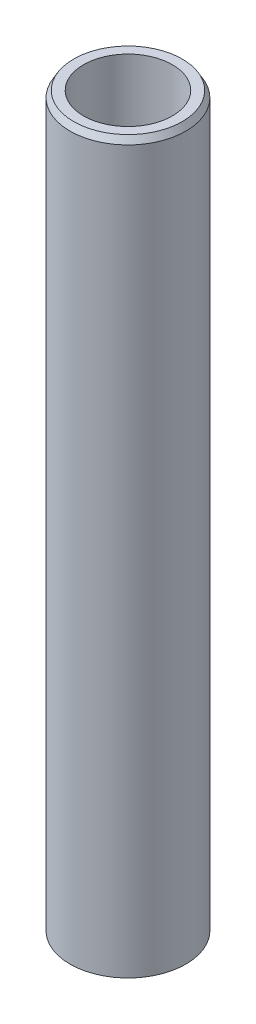
ISO-10303-21;
HEADER;
FILE_DESCRIPTION(('STEP AP214'),'2;1');
FILE_NAME('part.step','',(''),(''),'','','');
FILE_SCHEMA(('AUTOMOTIVE_DESIGN { 1 0 10303 214 1 1 1 1 }'));
ENDSEC;
DATA;
#1=APPLICATION_CONTEXT('core data for automotive mechanical design processes');
#2=APPLICATION_PROTOCOL_DEFINITION('international standard','automotive_design',2000,#1);
#3=PRODUCT_CONTEXT('',#1,'mechanical');
#4=PRODUCT('Part','Part','',(#3));
#5=PRODUCT_RELATED_PRODUCT_CATEGORY('part','',(#4));
#6=PRODUCT_DEFINITION_FORMATION('','',#4);
#7=PRODUCT_DEFINITION_CONTEXT('part definition',#1,'design');
#8=PRODUCT_DEFINITION('design','',#6,#7);
#9=PRODUCT_DEFINITION_SHAPE('','',#8);
#10=(LENGTH_UNIT() NAMED_UNIT(*) SI_UNIT(.MILLI.,.METRE.));
#11=(NAMED_UNIT(*) PLANE_ANGLE_UNIT() SI_UNIT($,.RADIAN.));
#12=(NAMED_UNIT(*) SI_UNIT($,.STERADIAN.) SOLID_ANGLE_UNIT());
#13=UNCERTAINTY_MEASURE_WITH_UNIT(LENGTH_MEASURE(1.E-05),#10,'distance_accuracy_value','');
#14=(GEOMETRIC_REPRESENTATION_CONTEXT(3) GLOBAL_UNCERTAINTY_ASSIGNED_CONTEXT((#13)) GLOBAL_UNIT_ASSIGNED_CONTEXT((#10,
#11,#12)) REPRESENTATION_CONTEXT('',''));
#15=CARTESIAN_POINT('',(0.,0.,0.));
#16=DIRECTION('',(0.,0.,1.));
#17=DIRECTION('',(1.,0.,0.));
#18=AXIS2_PLACEMENT_3D('',#15,#16,#17);
#19=CARTESIAN_POINT('',(0.,568.066885723914,0.));
#20=DIRECTION('',(0.,-1.,0.));
#21=DIRECTION('',(0.,0.,-1.));
#22=AXIS2_PLACEMENT_3D('',#19,#20,#21);
#23=CYLINDRICAL_SURFACE('',#22,45.);
#24=CARTESIAN_POINT('',(0.,563.117685613908,0.));
#25=DIRECTION('',(0.,1.,0.));
#26=DIRECTION('',(0.,0.,1.));
#27=AXIS2_PLACEMENT_3D('',#24,#25,#26);
#28=CIRCLE('',#27,45.);
#29=CARTESIAN_POINT('',(0.,563.117685613908,45.));
#30=VERTEX_POINT('',#29);
#31=EDGE_CURVE('E50',#30,#30,#28,.F.);
#32=ORIENTED_EDGE('',*,*,#31,.T.);
#33=EDGE_LOOP('',(#32));
#34=FACE_BOUND('',#33,.T.);
#35=CARTESIAN_POINT('',(0.,2.85742201578543,0.));
#36=DIRECTION('',(0.,1.,0.));
#37=DIRECTION('',(0.,0.,1.));
#38=AXIS2_PLACEMENT_3D('',#35,#36,#37);
#39=CIRCLE('',#38,45.);
#40=CARTESIAN_POINT('',(0.,2.85742201578543,45.));
#41=VERTEX_POINT('',#40);
#42=EDGE_CURVE('E51',#41,#41,#39,.T.);
#43=ORIENTED_EDGE('',*,*,#42,.T.);
#44=EDGE_LOOP('',(#43));
#45=FACE_BOUND('',#44,.T.);
#46=ADVANCED_FACE('F39',(#34,#45),#23,.T.);
#47=CARTESIAN_POINT('',(0.,568.066885723914,0.));
#48=DIRECTION('',(0.,1.,0.));
#49=DIRECTION('',(0.,0.,1.));
#50=AXIS2_PLACEMENT_3D('',#47,#48,#49);
#51=PLANE('',#50);
#52=CARTESIAN_POINT('',(0.,568.066885723914,0.));
#53=DIRECTION('',(0.,1.,0.));
#54=DIRECTION('',(0.,0.,1.));
#55=AXIS2_PLACEMENT_3D('',#52,#53,#54);
#56=CIRCLE('',#55,42.1425779842146);
#57=CARTESIAN_POINT('',(0.,568.066885723914,42.1425779842146));
#58=VERTEX_POINT('',#57);
#59=EDGE_CURVE('E54',#58,#58,#56,.T.);
#60=ORIENTED_EDGE('',*,*,#59,.T.);
#61=EDGE_LOOP('',(#60));
#62=FACE_BOUND('',#61,.T.);
#63=CARTESIAN_POINT('',(0.,568.066885723914,0.));
#64=DIRECTION('',(0.,1.,0.));
#65=DIRECTION('',(0.,0.,1.));
#66=AXIS2_PLACEMENT_3D('',#63,#64,#65);
#67=CIRCLE('',#66,34.4983136421875);
#68=CARTESIAN_POINT('',(0.,568.066885723914,34.4983136421875));
#69=VERTEX_POINT('',#68);
#70=EDGE_CURVE('E58',#69,#69,#67,.T.);
#71=ORIENTED_EDGE('',*,*,#70,.F.);
#72=EDGE_LOOP('',(#71));
#73=FACE_BOUND('',#72,.T.);
#74=ADVANCED_FACE('F69',(#62,#73),#51,.T.);
#75=CARTESIAN_POINT('',(0.,0.,0.));
#76=DIRECTION('',(0.,1.,0.));
#77=DIRECTION('',(0.,0.,1.));
#78=AXIS2_PLACEMENT_3D('',#75,#76,#77);
#79=PLANE('',#78);
#80=CARTESIAN_POINT('',(0.,0.,0.));
#81=DIRECTION('',(0.,1.,0.));
#82=DIRECTION('',(0.,0.,1.));
#83=AXIS2_PLACEMENT_3D('',#80,#81,#82);
#84=CIRCLE('',#83,40.0507998899937);
#85=CARTESIAN_POINT('',(0.,0.,40.0507998899937));
#86=VERTEX_POINT('',#85);
#87=EDGE_CURVE('E10',#86,#86,#84,.F.);
#88=ORIENTED_EDGE('',*,*,#87,.T.);
#89=EDGE_LOOP('',(#88));
#90=FACE_BOUND('',#89,.T.);
#91=CARTESIAN_POINT('',(0.,0.,0.));
#92=DIRECTION('',(0.,1.,0.));
#93=DIRECTION('',(0.,0.,1.));
#94=AXIS2_PLACEMENT_3D('',#91,#92,#93);
#95=CIRCLE('',#94,34.4983136421875);
#96=CARTESIAN_POINT('',(0.,0.,34.4983136421875));
#97=VERTEX_POINT('',#96);
#98=EDGE_CURVE('E63',#97,#97,#95,.T.);
#99=ORIENTED_EDGE('',*,*,#98,.T.);
#100=EDGE_LOOP('',(#99));
#101=FACE_BOUND('',#100,.T.);
#102=ADVANCED_FACE('F75',(#90,#101),#79,.F.);
#103=CARTESIAN_POINT('',(0.,568.066885723914,0.));
#104=DIRECTION('',(0.,-1.,0.));
#105=DIRECTION('',(0.,0.,-1.));
#106=AXIS2_PLACEMENT_3D('',#103,#104,#105);
#107=CYLINDRICAL_SURFACE('',#106,34.4983136421875);
#108=ORIENTED_EDGE('',*,*,#70,.T.);
#109=EDGE_LOOP('',(#108));
#110=FACE_BOUND('',#109,.T.);
#111=ORIENTED_EDGE('',*,*,#98,.F.);
#112=EDGE_LOOP('',(#111));
#113=FACE_BOUND('',#112,.T.);
#114=ADVANCED_FACE('F70',(#110,#113),#107,.F.);
#115=CARTESIAN_POINT('',(0.,568.066885723914,0.));
#116=DIRECTION('',(0.,-1.,0.));
#117=DIRECTION('',(0.,0.,-1.));
#118=AXIS2_PLACEMENT_3D('',#115,#116,#117);
#119=CONICAL_SURFACE('',#118,42.1425779842146,0.523598775598305);
#120=ORIENTED_EDGE('',*,*,#31,.F.);
#121=EDGE_LOOP('',(#120));
#122=FACE_BOUND('',#121,.T.);
#123=ORIENTED_EDGE('',*,*,#59,.F.);
#124=EDGE_LOOP('',(#123));
#125=FACE_BOUND('',#124,.T.);
#126=ADVANCED_FACE('F81',(#122,#125),#119,.T.);
#127=CARTESIAN_POINT('',(0.,2.85742201578543,0.));
#128=DIRECTION('',(0.,1.,0.));
#129=DIRECTION('',(0.,0.,1.));
#130=AXIS2_PLACEMENT_3D('',#127,#128,#129);
#131=CONICAL_SURFACE('',#130,45.,1.0471975511966);
#132=ORIENTED_EDGE('',*,*,#87,.F.);
#133=EDGE_LOOP('',(#132));
#134=FACE_BOUND('',#133,.T.);
#135=ORIENTED_EDGE('',*,*,#42,.F.);
#136=EDGE_LOOP('',(#135));
#137=FACE_BOUND('',#136,.T.);
#138=ADVANCED_FACE('F45',(#134,#137),#131,.T.);
#139=CLOSED_SHELL('',(#46,#74,#102,#114,#126,#138));
#140=MANIFOLD_SOLID_BREP('B2',#139);
#141=ADVANCED_BREP_SHAPE_REPRESENTATION('',(#18,#140),#14);
#142=SHAPE_DEFINITION_REPRESENTATION(#9,#141);
ENDSEC;
END-ISO-10303-21;
